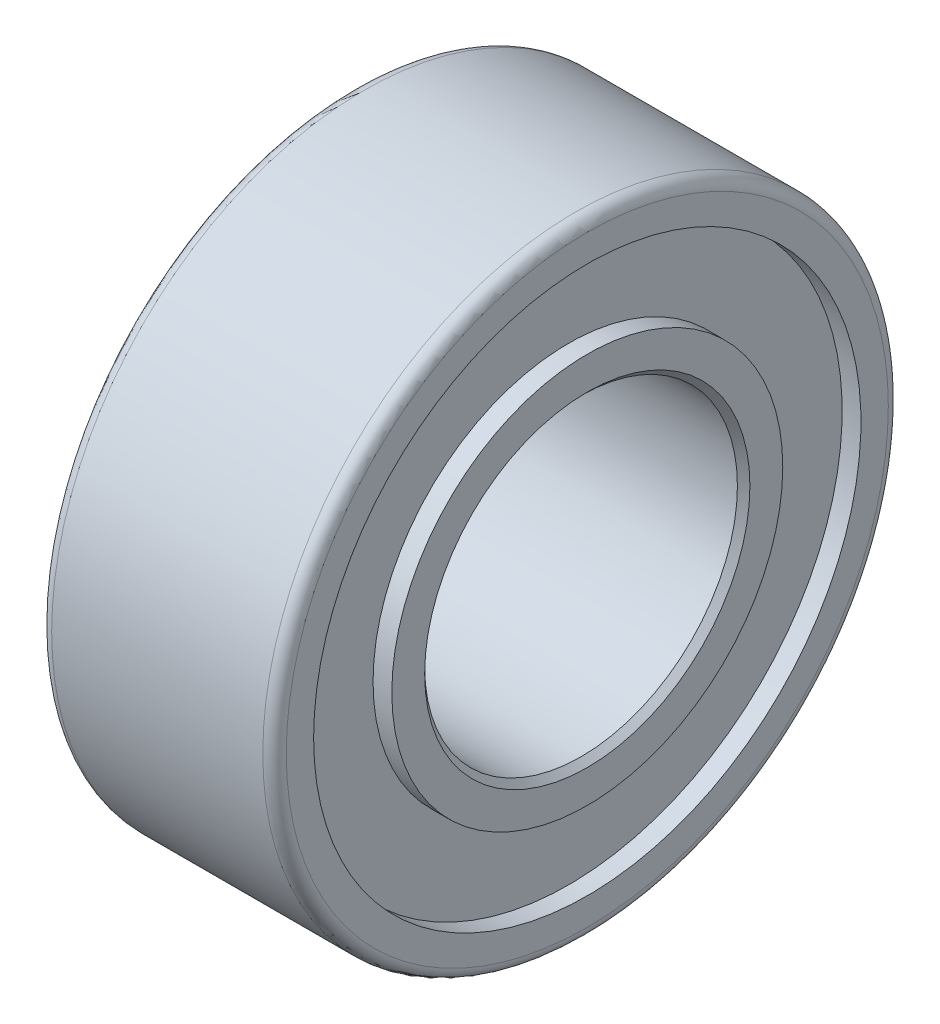
ISO-10303-21;
HEADER;
FILE_DESCRIPTION(('STEP AP214'),'2;1');
FILE_NAME('part.step','',(''),(''),'','','');
FILE_SCHEMA(('AUTOMOTIVE_DESIGN { 1 0 10303 214 1 1 1 1 }'));
ENDSEC;
DATA;
#1=APPLICATION_CONTEXT('core data for automotive mechanical design processes');
#2=APPLICATION_PROTOCOL_DEFINITION('international standard','automotive_design',2000,#1);
#3=PRODUCT_CONTEXT('',#1,'mechanical');
#4=PRODUCT('Part','Part','',(#3));
#5=PRODUCT_RELATED_PRODUCT_CATEGORY('part','',(#4));
#6=PRODUCT_DEFINITION_FORMATION('','',#4);
#7=PRODUCT_DEFINITION_CONTEXT('part definition',#1,'design');
#8=PRODUCT_DEFINITION('design','',#6,#7);
#9=PRODUCT_DEFINITION_SHAPE('','',#8);
#10=(LENGTH_UNIT() NAMED_UNIT(*) SI_UNIT(.MILLI.,.METRE.));
#11=(NAMED_UNIT(*) PLANE_ANGLE_UNIT() SI_UNIT($,.RADIAN.));
#12=(NAMED_UNIT(*) SI_UNIT($,.STERADIAN.) SOLID_ANGLE_UNIT());
#13=UNCERTAINTY_MEASURE_WITH_UNIT(LENGTH_MEASURE(1.E-05),#10,'distance_accuracy_value','');
#14=(GEOMETRIC_REPRESENTATION_CONTEXT(3) GLOBAL_UNCERTAINTY_ASSIGNED_CONTEXT((#13)) GLOBAL_UNIT_ASSIGNED_CONTEXT((#10,
#11,#12)) REPRESENTATION_CONTEXT('',''));
#15=CARTESIAN_POINT('',(0.,0.,0.));
#16=DIRECTION('',(0.,0.,1.));
#17=DIRECTION('',(1.,0.,0.));
#18=AXIS2_PLACEMENT_3D('',#15,#16,#17);
#19=CARTESIAN_POINT('',(0.,0.,0.));
#20=DIRECTION('',(-1.,0.,0.));
#21=DIRECTION('',(0.,0.,1.));
#22=AXIS2_PLACEMENT_3D('',#19,#20,#21);
#23=CYLINDRICAL_SURFACE('',#22,3.175);
#24=CARTESIAN_POINT('',(-2.25424999996449,0.,0.));
#25=DIRECTION('',(-1.,0.,0.));
#26=DIRECTION('',(0.,0.,1.));
#27=AXIS2_PLACEMENT_3D('',#24,#25,#26);
#28=CIRCLE('',#27,3.17499999999882);
#29=CARTESIAN_POINT('',(-2.25424999996449,0.,3.17499999999882));
#30=VERTEX_POINT('',#29);
#31=EDGE_CURVE('E66',#30,#30,#28,.T.);
#32=ORIENTED_EDGE('',*,*,#31,.T.);
#33=EDGE_LOOP('',(#32));
#34=FACE_BOUND('',#33,.T.);
#35=CARTESIAN_POINT('',(2.25425000002133,0.,0.));
#36=DIRECTION('',(1.,0.,0.));
#37=DIRECTION('',(0.,0.,-1.));
#38=AXIS2_PLACEMENT_3D('',#35,#36,#37);
#39=CIRCLE('',#38,3.17500000005566);
#40=CARTESIAN_POINT('',(2.25425000002133,0.,-3.17500000005566));
#41=VERTEX_POINT('',#40);
#42=EDGE_CURVE('E259',#41,#41,#39,.T.);
#43=ORIENTED_EDGE('',*,*,#42,.T.);
#44=EDGE_LOOP('',(#43));
#45=FACE_BOUND('',#44,.T.);
#46=ADVANCED_FACE('F18',(#34,#45),#23,.F.);
#47=CARTESIAN_POINT('',(2.38125000004175,0.,0.));
#48=DIRECTION('',(1.,0.,0.));
#49=DIRECTION('',(0.,0.,-1.));
#50=AXIS2_PLACEMENT_3D('',#47,#48,#49);
#51=CONICAL_SURFACE('',#50,3.30200000001923,0.785398163173655);
#52=CARTESIAN_POINT('',(2.38125000004175,0.,0.));
#53=DIRECTION('',(1.,0.,0.));
#54=DIRECTION('',(0.,0.,-1.));
#55=AXIS2_PLACEMENT_3D('',#52,#53,#54);
#56=CIRCLE('',#55,3.30200000001923);
#57=CARTESIAN_POINT('',(2.38125000004175,0.,-3.30200000001923));
#58=VERTEX_POINT('',#57);
#59=EDGE_CURVE('E281',#58,#58,#56,.T.);
#60=ORIENTED_EDGE('',*,*,#59,.T.);
#61=EDGE_LOOP('',(#60));
#62=FACE_BOUND('',#61,.T.);
#63=ORIENTED_EDGE('',*,*,#42,.F.);
#64=EDGE_LOOP('',(#63));
#65=FACE_BOUND('',#64,.T.);
#66=ADVANCED_FACE('F162',(#62,#65),#51,.F.);
#67=CARTESIAN_POINT('',(-2.38124999992806,0.,0.));
#68=DIRECTION('',(-1.,0.,0.));
#69=DIRECTION('',(0.,0.,1.));
#70=AXIS2_PLACEMENT_3D('',#67,#68,#69);
#71=CONICAL_SURFACE('',#70,3.30199999990555,0.785398163397448);
#72=CARTESIAN_POINT('',(-2.3812499999849,0.,0.));
#73=DIRECTION('',(-1.,0.,0.));
#74=DIRECTION('',(0.,0.,1.));
#75=AXIS2_PLACEMENT_3D('',#72,#73,#74);
#76=CIRCLE('',#75,3.30199999996239);
#77=CARTESIAN_POINT('',(-2.3812499999849,0.,3.30199999996239));
#78=VERTEX_POINT('',#77);
#79=EDGE_CURVE('E278',#78,#78,#76,.T.);
#80=ORIENTED_EDGE('',*,*,#79,.T.);
#81=EDGE_LOOP('',(#80));
#82=FACE_BOUND('',#81,.T.);
#83=ORIENTED_EDGE('',*,*,#31,.F.);
#84=EDGE_LOOP('',(#83));
#85=FACE_BOUND('',#84,.T.);
#86=ADVANCED_FACE('F159',(#82,#85),#71,.F.);
#87=CARTESIAN_POINT('',(2.38125,3.175,0.));
#88=DIRECTION('',(-1.,0.,0.));
#89=DIRECTION('',(0.,0.,1.));
#90=AXIS2_PLACEMENT_3D('',#87,#88,#89);
#91=PLANE('',#90);
#92=CARTESIAN_POINT('',(2.38125,0.,0.));
#93=DIRECTION('',(-1.,0.,0.));
#94=DIRECTION('',(0.,0.,1.));
#95=AXIS2_PLACEMENT_3D('',#92,#93,#94);
#96=CIRCLE('',#95,3.96875);
#97=CARTESIAN_POINT('',(2.38125,0.,3.96875));
#98=VERTEX_POINT('',#97);
#99=EDGE_CURVE('E275',#98,#98,#96,.T.);
#100=ORIENTED_EDGE('',*,*,#99,.F.);
#101=EDGE_LOOP('',(#100));
#102=FACE_BOUND('',#101,.T.);
#103=ORIENTED_EDGE('',*,*,#59,.F.);
#104=EDGE_LOOP('',(#103));
#105=FACE_BOUND('',#104,.T.);
#106=ADVANCED_FACE('F155',(#102,#105),#91,.F.);
#107=CARTESIAN_POINT('',(-2.38125,3.96875,0.));
#108=DIRECTION('',(1.,0.,0.));
#109=DIRECTION('',(0.,0.,-1.));
#110=AXIS2_PLACEMENT_3D('',#107,#108,#109);
#111=PLANE('',#110);
#112=CARTESIAN_POINT('',(-2.38125,0.,0.));
#113=DIRECTION('',(-1.,0.,0.));
#114=DIRECTION('',(0.,0.,1.));
#115=AXIS2_PLACEMENT_3D('',#112,#113,#114);
#116=CIRCLE('',#115,3.96875);
#117=CARTESIAN_POINT('',(-2.38125,0.,3.96875));
#118=VERTEX_POINT('',#117);
#119=EDGE_CURVE('E272',#118,#118,#116,.F.);
#120=ORIENTED_EDGE('',*,*,#119,.F.);
#121=EDGE_LOOP('',(#120));
#122=FACE_BOUND('',#121,.T.);
#123=ORIENTED_EDGE('',*,*,#79,.F.);
#124=EDGE_LOOP('',(#123));
#125=FACE_BOUND('',#124,.T.);
#126=ADVANCED_FACE('F151',(#122,#125),#111,.F.);
#127=CARTESIAN_POINT('',(0.,0.,0.));
#128=DIRECTION('',(-1.,0.,0.));
#129=DIRECTION('',(0.,0.,1.));
#130=AXIS2_PLACEMENT_3D('',#127,#128,#129);
#131=CYLINDRICAL_SURFACE('',#130,3.96875);
#132=CARTESIAN_POINT('',(2.00025,0.,0.));
#133=DIRECTION('',(-1.,0.,0.));
#134=DIRECTION('',(0.,0.,1.));
#135=AXIS2_PLACEMENT_3D('',#132,#133,#134);
#136=CIRCLE('',#135,3.96875);
#137=CARTESIAN_POINT('',(2.00025,0.,3.96875));
#138=VERTEX_POINT('',#137);
#139=EDGE_CURVE('E269',#138,#138,#136,.F.);
#140=ORIENTED_EDGE('',*,*,#139,.T.);
#141=EDGE_LOOP('',(#140));
#142=FACE_BOUND('',#141,.T.);
#143=ORIENTED_EDGE('',*,*,#99,.T.);
#144=EDGE_LOOP('',(#143));
#145=FACE_BOUND('',#144,.T.);
#146=ADVANCED_FACE('F147',(#142,#145),#131,.T.);
#147=CARTESIAN_POINT('',(0.,0.,0.));
#148=DIRECTION('',(-1.,0.,0.));
#149=DIRECTION('',(0.,0.,1.));
#150=AXIS2_PLACEMENT_3D('',#147,#148,#149);
#151=CYLINDRICAL_SURFACE('',#150,3.96875);
#152=ORIENTED_EDGE('',*,*,#119,.T.);
#153=EDGE_LOOP('',(#152));
#154=FACE_BOUND('',#153,.T.);
#155=CARTESIAN_POINT('',(-2.00025,0.,0.));
#156=DIRECTION('',(-1.,0.,0.));
#157=DIRECTION('',(0.,0.,1.));
#158=AXIS2_PLACEMENT_3D('',#155,#156,#157);
#159=CIRCLE('',#158,3.96875);
#160=CARTESIAN_POINT('',(-2.00025,0.,3.96875));
#161=VERTEX_POINT('',#160);
#162=EDGE_CURVE('E266',#161,#161,#159,.T.);
#163=ORIENTED_EDGE('',*,*,#162,.T.);
#164=EDGE_LOOP('',(#163));
#165=FACE_BOUND('',#164,.T.);
#166=ADVANCED_FACE('F143',(#154,#165),#151,.T.);
#167=CARTESIAN_POINT('',(2.00025,3.96875,0.));
#168=DIRECTION('',(-1.,0.,0.));
#169=DIRECTION('',(0.,0.,1.));
#170=AXIS2_PLACEMENT_3D('',#167,#168,#169);
#171=PLANE('',#170);
#172=ORIENTED_EDGE('',*,*,#139,.F.);
#173=EDGE_LOOP('',(#172));
#174=FACE_BOUND('',#173,.T.);
#175=CARTESIAN_POINT('',(2.00025,0.,0.));
#176=DIRECTION('',(-1.,0.,0.));
#177=DIRECTION('',(0.,0.,1.));
#178=AXIS2_PLACEMENT_3D('',#175,#176,#177);
#179=CIRCLE('',#178,5.55625);
#180=CARTESIAN_POINT('',(2.00025,0.,5.55625));
#181=VERTEX_POINT('',#180);
#182=EDGE_CURVE('E263',#181,#181,#179,.F.);
#183=ORIENTED_EDGE('',*,*,#182,.T.);
#184=EDGE_LOOP('',(#183));
#185=FACE_BOUND('',#184,.T.);
#186=ADVANCED_FACE('F139',(#174,#185),#171,.F.);
#187=CARTESIAN_POINT('',(-2.00025,5.55625,0.));
#188=DIRECTION('',(1.,0.,0.));
#189=DIRECTION('',(0.,0.,-1.));
#190=AXIS2_PLACEMENT_3D('',#187,#188,#189);
#191=PLANE('',#190);
#192=CARTESIAN_POINT('',(-2.00025,0.,0.));
#193=DIRECTION('',(-1.,0.,0.));
#194=DIRECTION('',(0.,0.,1.));
#195=AXIS2_PLACEMENT_3D('',#192,#193,#194);
#196=CIRCLE('',#195,5.55625);
#197=CARTESIAN_POINT('',(-2.00025,0.,5.55625));
#198=VERTEX_POINT('',#197);
#199=EDGE_CURVE('E257',#198,#198,#196,.T.);
#200=ORIENTED_EDGE('',*,*,#199,.T.);
#201=EDGE_LOOP('',(#200));
#202=FACE_BOUND('',#201,.T.);
#203=ORIENTED_EDGE('',*,*,#162,.F.);
#204=EDGE_LOOP('',(#203));
#205=FACE_BOUND('',#204,.T.);
#206=ADVANCED_FACE('F135',(#202,#205),#191,.F.);
#207=CARTESIAN_POINT('',(0.,0.,0.));
#208=DIRECTION('',(-1.,0.,0.));
#209=DIRECTION('',(0.,0.,1.));
#210=AXIS2_PLACEMENT_3D('',#207,#208,#209);
#211=CYLINDRICAL_SURFACE('',#210,5.55625);
#212=CARTESIAN_POINT('',(2.38125,0.,0.));
#213=DIRECTION('',(-1.,0.,0.));
#214=DIRECTION('',(0.,0.,1.));
#215=AXIS2_PLACEMENT_3D('',#212,#213,#214);
#216=CIRCLE('',#215,5.55625);
#217=CARTESIAN_POINT('',(2.38125,0.,5.55625));
#218=VERTEX_POINT('',#217);
#219=EDGE_CURVE('E254',#218,#218,#216,.F.);
#220=ORIENTED_EDGE('',*,*,#219,.T.);
#221=EDGE_LOOP('',(#220));
#222=FACE_BOUND('',#221,.T.);
#223=ORIENTED_EDGE('',*,*,#182,.F.);
#224=EDGE_LOOP('',(#223));
#225=FACE_BOUND('',#224,.T.);
#226=ADVANCED_FACE('F131',(#222,#225),#211,.F.);
#227=CARTESIAN_POINT('',(0.,0.,0.));
#228=DIRECTION('',(-1.,0.,0.));
#229=DIRECTION('',(0.,0.,1.));
#230=AXIS2_PLACEMENT_3D('',#227,#228,#229);
#231=CYLINDRICAL_SURFACE('',#230,5.55625);
#232=ORIENTED_EDGE('',*,*,#199,.F.);
#233=EDGE_LOOP('',(#232));
#234=FACE_BOUND('',#233,.T.);
#235=CARTESIAN_POINT('',(-2.38125,0.,0.));
#236=DIRECTION('',(-1.,0.,0.));
#237=DIRECTION('',(0.,0.,1.));
#238=AXIS2_PLACEMENT_3D('',#235,#236,#237);
#239=CIRCLE('',#238,5.55625);
#240=CARTESIAN_POINT('',(-2.38125,0.,5.55625));
#241=VERTEX_POINT('',#240);
#242=EDGE_CURVE('E53',#241,#241,#239,.T.);
#243=ORIENTED_EDGE('',*,*,#242,.T.);
#244=EDGE_LOOP('',(#243));
#245=FACE_BOUND('',#244,.T.);
#246=ADVANCED_FACE('F126',(#234,#245),#231,.F.);
#247=CARTESIAN_POINT('',(2.38125,5.55625,0.));
#248=DIRECTION('',(-1.,0.,0.));
#249=DIRECTION('',(0.,0.,1.));
#250=AXIS2_PLACEMENT_3D('',#247,#248,#249);
#251=PLANE('',#250);
#252=ORIENTED_EDGE('',*,*,#219,.F.);
#253=EDGE_LOOP('',(#252));
#254=FACE_BOUND('',#253,.T.);
#255=CARTESIAN_POINT('',(2.38125,0.,0.));
#256=DIRECTION('',(-1.,0.,0.));
#257=DIRECTION('',(0.,0.,1.));
#258=AXIS2_PLACEMENT_3D('',#255,#256,#257);
#259=CIRCLE('',#258,6.111875);
#260=CARTESIAN_POINT('',(2.38125,0.,6.111875));
#261=VERTEX_POINT('',#260);
#262=CARTESIAN_POINT('',(2.38125,0.,-6.111875));
#263=VERTEX_POINT('',#262);
#264=EDGE_CURVE('E46',#261,#263,#259,.T.);
#265=ORIENTED_EDGE('',*,*,#264,.F.);
#266=CARTESIAN_POINT('',(2.38125,0.,0.));
#267=DIRECTION('',(-1.,0.,0.));
#268=DIRECTION('',(0.,0.,-1.));
#269=AXIS2_PLACEMENT_3D('',#266,#267,#268);
#270=CIRCLE('',#269,6.111875);
#271=EDGE_CURVE('E49',#263,#261,#270,.T.);
#272=ORIENTED_EDGE('',*,*,#271,.F.);
#273=EDGE_LOOP('',(#265,#272));
#274=FACE_BOUND('',#273,.T.);
#275=ADVANCED_FACE('F51',(#254,#274),#251,.F.);
#276=CARTESIAN_POINT('',(-2.38125,6.35,0.));
#277=DIRECTION('',(1.,0.,0.));
#278=DIRECTION('',(0.,0.,-1.));
#279=AXIS2_PLACEMENT_3D('',#276,#277,#278);
#280=PLANE('',#279);
#281=ORIENTED_EDGE('',*,*,#242,.F.);
#282=EDGE_LOOP('',(#281));
#283=FACE_BOUND('',#282,.T.);
#284=CARTESIAN_POINT('',(-2.38125,0.,0.));
#285=DIRECTION('',(1.,0.,0.));
#286=DIRECTION('',(0.,0.,-1.));
#287=AXIS2_PLACEMENT_3D('',#284,#285,#286);
#288=CIRCLE('',#287,6.111875);
#289=CARTESIAN_POINT('',(-2.38125,0.,-6.111875));
#290=VERTEX_POINT('',#289);
#291=CARTESIAN_POINT('',(-2.38125,0.,6.111875));
#292=VERTEX_POINT('',#291);
#293=EDGE_CURVE('E58',#290,#292,#288,.T.);
#294=ORIENTED_EDGE('',*,*,#293,.F.);
#295=CARTESIAN_POINT('',(-2.38125,0.,0.));
#296=DIRECTION('',(1.,0.,0.));
#297=DIRECTION('',(0.,0.,1.));
#298=AXIS2_PLACEMENT_3D('',#295,#296,#297);
#299=CIRCLE('',#298,6.111875);
#300=EDGE_CURVE('E37',#292,#290,#299,.T.);
#301=ORIENTED_EDGE('',*,*,#300,.F.);
#302=EDGE_LOOP('',(#294,#301));
#303=FACE_BOUND('',#302,.T.);
#304=ADVANCED_FACE('F79',(#283,#303),#280,.F.);
#305=CARTESIAN_POINT('',(2.143125,0.,0.));
#306=DIRECTION('',(-1.,0.,0.));
#307=DIRECTION('',(0.,0.,1.));
#308=AXIS2_PLACEMENT_3D('',#305,#306,#307);
#309=TOROIDAL_SURFACE('',#308,6.111875,0.238125);
#310=CARTESIAN_POINT('',(2.143125,0.,0.));
#311=DIRECTION('',(-1.,0.,0.));
#312=DIRECTION('',(0.,0.,1.));
#313=AXIS2_PLACEMENT_3D('',#310,#311,#312);
#314=CIRCLE('',#313,6.35);
#315=CARTESIAN_POINT('',(2.143125,0.,6.35));
#316=VERTEX_POINT('',#315);
#317=EDGE_CURVE('E29',#316,#316,#314,.T.);
#318=ORIENTED_EDGE('',*,*,#317,.F.);
#319=EDGE_LOOP('',(#318));
#320=FACE_BOUND('',#319,.T.);
#321=ORIENTED_EDGE('',*,*,#264,.T.);
#322=ORIENTED_EDGE('',*,*,#271,.T.);
#323=EDGE_LOOP('',(#321,#322));
#324=FACE_BOUND('',#323,.T.);
#325=ADVANCED_FACE('F57',(#320,#324),#309,.T.);
#326=CARTESIAN_POINT('',(-2.143125,0.,0.));
#327=DIRECTION('',(1.,0.,0.));
#328=DIRECTION('',(0.,0.,-1.));
#329=AXIS2_PLACEMENT_3D('',#326,#327,#328);
#330=TOROIDAL_SURFACE('',#329,6.111875,0.238125);
#331=CARTESIAN_POINT('',(-2.143125,0.,0.));
#332=DIRECTION('',(-1.,0.,0.));
#333=DIRECTION('',(0.,0.,1.));
#334=AXIS2_PLACEMENT_3D('',#331,#332,#333);
#335=CIRCLE('',#334,6.35);
#336=CARTESIAN_POINT('',(-2.143125,0.,6.35));
#337=VERTEX_POINT('',#336);
#338=EDGE_CURVE('E11',#337,#337,#335,.F.);
#339=ORIENTED_EDGE('',*,*,#338,.F.);
#340=EDGE_LOOP('',(#339));
#341=FACE_BOUND('',#340,.T.);
#342=ORIENTED_EDGE('',*,*,#293,.T.);
#343=ORIENTED_EDGE('',*,*,#300,.T.);
#344=EDGE_LOOP('',(#342,#343));
#345=FACE_BOUND('',#344,.T.);
#346=ADVANCED_FACE('F78',(#341,#345),#330,.T.);
#347=CARTESIAN_POINT('',(0.,0.,0.));
#348=DIRECTION('',(-1.,0.,0.));
#349=DIRECTION('',(0.,0.,1.));
#350=AXIS2_PLACEMENT_3D('',#347,#348,#349);
#351=CYLINDRICAL_SURFACE('',#350,6.35);
#352=ORIENTED_EDGE('',*,*,#338,.T.);
#353=EDGE_LOOP('',(#352));
#354=FACE_BOUND('',#353,.T.);
#355=ORIENTED_EDGE('',*,*,#317,.T.);
#356=EDGE_LOOP('',(#355));
#357=FACE_BOUND('',#356,.T.);
#358=ADVANCED_FACE('F173',(#354,#357),#351,.T.);
#359=CLOSED_SHELL('',(#46,#66,#86,#106,#126,#146,#166,#186,#206,#226,#246,#275,#304,#325,#346,#358));
#360=MANIFOLD_SOLID_BREP('B1',#359);
#361=ADVANCED_BREP_SHAPE_REPRESENTATION('',(#18,#360),#14);
#362=SHAPE_DEFINITION_REPRESENTATION(#9,#361);
ENDSEC;
END-ISO-10303-21;
